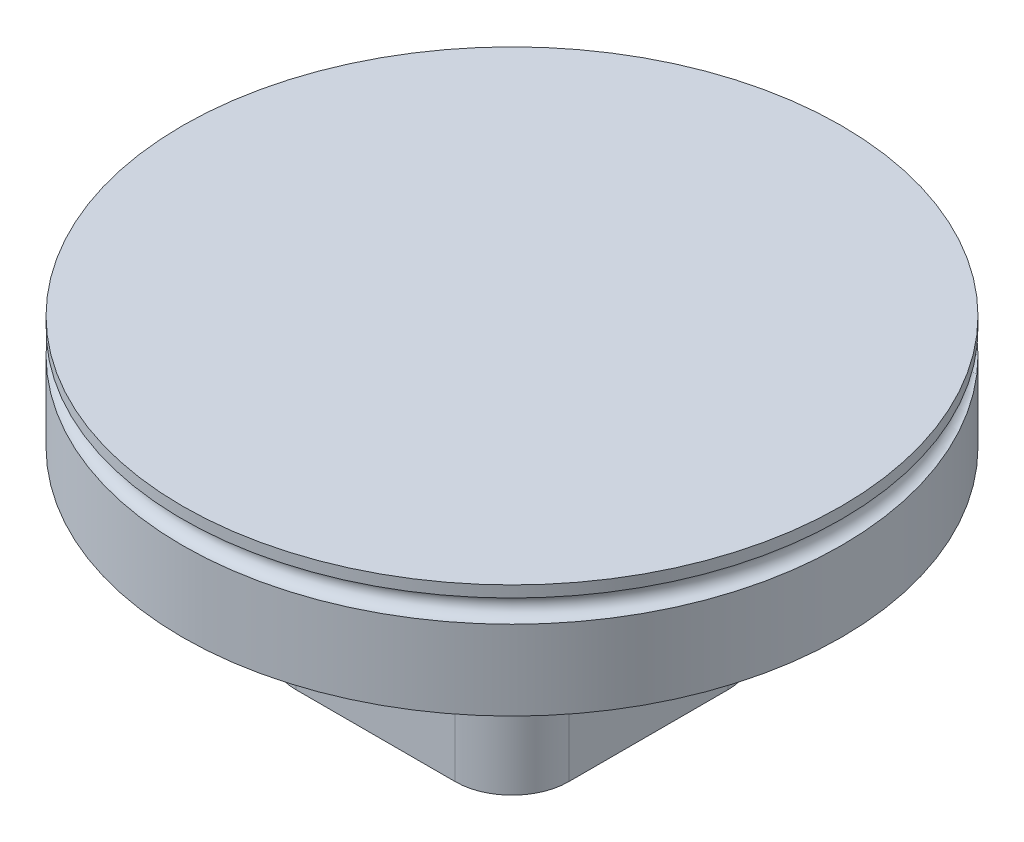
ISO-10303-21;
HEADER;
FILE_DESCRIPTION(('STEP AP214'),'2;1');
FILE_NAME('part.step','',(''),(''),'','','');
FILE_SCHEMA(('AUTOMOTIVE_DESIGN { 1 0 10303 214 1 1 1 1 }'));
ENDSEC;
DATA;
#1=APPLICATION_CONTEXT('core data for automotive mechanical design processes');
#2=APPLICATION_PROTOCOL_DEFINITION('international standard','automotive_design',2000,#1);
#3=PRODUCT_CONTEXT('',#1,'mechanical');
#4=PRODUCT('Part','Part','',(#3));
#5=PRODUCT_RELATED_PRODUCT_CATEGORY('part','',(#4));
#6=PRODUCT_DEFINITION_FORMATION('','',#4);
#7=PRODUCT_DEFINITION_CONTEXT('part definition',#1,'design');
#8=PRODUCT_DEFINITION('design','',#6,#7);
#9=PRODUCT_DEFINITION_SHAPE('','',#8);
#10=(LENGTH_UNIT() NAMED_UNIT(*) SI_UNIT(.MILLI.,.METRE.));
#11=(NAMED_UNIT(*) PLANE_ANGLE_UNIT() SI_UNIT($,.RADIAN.));
#12=(NAMED_UNIT(*) SI_UNIT($,.STERADIAN.) SOLID_ANGLE_UNIT());
#13=UNCERTAINTY_MEASURE_WITH_UNIT(LENGTH_MEASURE(1.E-05),#10,'distance_accuracy_value','');
#14=(GEOMETRIC_REPRESENTATION_CONTEXT(3) GLOBAL_UNCERTAINTY_ASSIGNED_CONTEXT((#13)) GLOBAL_UNIT_ASSIGNED_CONTEXT((#10,
#11,#12)) REPRESENTATION_CONTEXT('',''));
#15=CARTESIAN_POINT('',(0.,0.,0.));
#16=DIRECTION('',(0.,0.,1.));
#17=DIRECTION('',(1.,0.,0.));
#18=AXIS2_PLACEMENT_3D('',#15,#16,#17);
#19=CARTESIAN_POINT('',(0.,10.,0.));
#20=DIRECTION('',(0.,-1.,0.));
#21=DIRECTION('',(0.,0.,-1.00000000000001));
#22=AXIS2_PLACEMENT_3D('',#19,#20,#21);
#23=CYLINDRICAL_SURFACE('',#22,29.);
#24=CARTESIAN_POINT('',(0.,0.,0.));
#25=DIRECTION('',(0.,1.,0.));
#26=DIRECTION('',(0.,0.,1.00000000000001));
#27=AXIS2_PLACEMENT_3D('',#24,#25,#26);
#28=CIRCLE('',#27,29.);
#29=CARTESIAN_POINT('',(0.,0.,29.0000000000002));
#30=VERTEX_POINT('',#29);
#31=EDGE_CURVE('E157',#30,#30,#28,.T.);
#32=ORIENTED_EDGE('',*,*,#31,.T.);
#33=EDGE_LOOP('',(#32));
#34=FACE_BOUND('',#33,.T.);
#35=CARTESIAN_POINT('',(0.,7.,0.));
#36=DIRECTION('',(0.,1.,0.));
#37=DIRECTION('',(-1.00000000000001,0.,0.));
#38=AXIS2_PLACEMENT_3D('',#35,#36,#37);
#39=CIRCLE('',#38,29.);
#40=CARTESIAN_POINT('',(-29.0000000000002,7.00000000000002,0.));
#41=VERTEX_POINT('',#40);
#42=EDGE_CURVE('E50',#41,#41,#39,.T.);
#43=ORIENTED_EDGE('',*,*,#42,.F.);
#44=EDGE_LOOP('',(#43));
#45=FACE_BOUND('',#44,.T.);
#46=ADVANCED_FACE('F46',(#34,#45),#23,.T.);
#47=CARTESIAN_POINT('',(0.,0.,0.));
#48=DIRECTION('',(0.,1.,0.));
#49=DIRECTION('',(0.,0.,1.00000000000001));
#50=AXIS2_PLACEMENT_3D('',#47,#48,#49);
#51=PLANE('',#50);
#52=DIRECTION('',(0.,0.,-1.00000000000001));
#53=VECTOR('',#52,1.);
#54=CARTESIAN_POINT('',(-14.0000000000001,0.,7.00000000000003));
#55=LINE('',#54,#53);
#56=CARTESIAN_POINT('',(-14.0000000000001,0.,-7.));
#57=VERTEX_POINT('',#56);
#58=CARTESIAN_POINT('',(-14.0000000000001,0.,7.00000000000003));
#59=VERTEX_POINT('',#58);
#60=EDGE_CURVE('E195',#57,#59,#55,.F.);
#61=ORIENTED_EDGE('',*,*,#60,.T.);
#62=CARTESIAN_POINT('',(-7.00000000000004,0.,7.00000000000012));
#63=DIRECTION('',(0.,1.,0.));
#64=DIRECTION('',(0.,0.,1.00000000000001));
#65=AXIS2_PLACEMENT_3D('',#62,#63,#64);
#66=CIRCLE('',#65,7.);
#67=CARTESIAN_POINT('',(-7.00000000000005,0.,14.0000000000001));
#68=VERTEX_POINT('',#67);
#69=EDGE_CURVE('E216',#59,#68,#66,.T.);
#70=ORIENTED_EDGE('',*,*,#69,.T.);
#71=DIRECTION('',(-1.00000000000001,0.,0.));
#72=VECTOR('',#71,1.);
#73=CARTESIAN_POINT('',(7.00000000000004,0.,14.0000000000001));
#74=LINE('',#73,#72);
#75=CARTESIAN_POINT('',(7.00000000000004,0.,14.0000000000001));
#76=VERTEX_POINT('',#75);
#77=EDGE_CURVE('E213',#68,#76,#74,.F.);
#78=ORIENTED_EDGE('',*,*,#77,.T.);
#79=CARTESIAN_POINT('',(7.00000000000005,0.,7.00000000000012));
#80=DIRECTION('',(0.,1.,0.));
#81=DIRECTION('',(0.,0.,1.00000000000001));
#82=AXIS2_PLACEMENT_3D('',#79,#80,#81);
#83=CIRCLE('',#82,7.);
#84=CARTESIAN_POINT('',(14.0000000000001,0.,7.00000000000001));
#85=VERTEX_POINT('',#84);
#86=EDGE_CURVE('E210',#76,#85,#83,.T.);
#87=ORIENTED_EDGE('',*,*,#86,.T.);
#88=DIRECTION('',(0.,0.,1.00000000000001));
#89=VECTOR('',#88,1.);
#90=CARTESIAN_POINT('',(14.0000000000001,0.,-7.));
#91=LINE('',#90,#89);
#92=CARTESIAN_POINT('',(14.0000000000001,0.,-7.));
#93=VERTEX_POINT('',#92);
#94=EDGE_CURVE('E207',#85,#93,#91,.F.);
#95=ORIENTED_EDGE('',*,*,#94,.T.);
#96=CARTESIAN_POINT('',(7.00000000000004,0.,-6.99999999999996));
#97=DIRECTION('',(0.,1.,0.));
#98=DIRECTION('',(0.,0.,1.00000000000001));
#99=AXIS2_PLACEMENT_3D('',#96,#97,#98);
#100=CIRCLE('',#99,7.);
#101=CARTESIAN_POINT('',(7.00000000000004,0.,-14.));
#102=VERTEX_POINT('',#101);
#103=EDGE_CURVE('E204',#93,#102,#100,.T.);
#104=ORIENTED_EDGE('',*,*,#103,.T.);
#105=DIRECTION('',(1.00000000000001,0.,0.));
#106=VECTOR('',#105,1.);
#107=CARTESIAN_POINT('',(-7.00000000000005,0.,-14.));
#108=LINE('',#107,#106);
#109=CARTESIAN_POINT('',(-7.00000000000005,0.,-14.));
#110=VERTEX_POINT('',#109);
#111=EDGE_CURVE('E201',#102,#110,#108,.F.);
#112=ORIENTED_EDGE('',*,*,#111,.T.);
#113=CARTESIAN_POINT('',(-7.00000000000005,0.,-6.99999999999996));
#114=DIRECTION('',(0.,1.,0.));
#115=DIRECTION('',(0.,0.,1.00000000000001));
#116=AXIS2_PLACEMENT_3D('',#113,#114,#115);
#117=CIRCLE('',#116,7.);
#118=EDGE_CURVE('E198',#110,#57,#117,.T.);
#119=ORIENTED_EDGE('',*,*,#118,.T.);
#120=EDGE_LOOP('',(#61,#70,#78,#87,#95,#104,#112,#119));
#121=FACE_BOUND('',#120,.T.);
#122=ORIENTED_EDGE('',*,*,#31,.F.);
#123=EDGE_LOOP('',(#122));
#124=FACE_BOUND('',#123,.T.);
#125=ADVANCED_FACE('F285',(#121,#124),#51,.F.);
#126=CARTESIAN_POINT('',(0.,-16.,0.));
#127=DIRECTION('',(0.,1.,0.));
#128=DIRECTION('',(0.,0.,1.00000000000001));
#129=AXIS2_PLACEMENT_3D('',#126,#127,#128);
#130=PLANE('',#129);
#131=DIRECTION('',(0.,0.,-1.00000000000001));
#132=VECTOR('',#131,1.);
#133=CARTESIAN_POINT('',(-12.0000000000001,-16.,-12.));
#134=LINE('',#133,#132);
#135=CARTESIAN_POINT('',(-12.0000000000001,-16.,7.00000000000001));
#136=VERTEX_POINT('',#135);
#137=CARTESIAN_POINT('',(-12.0000000000001,-16.,-7.));
#138=VERTEX_POINT('',#137);
#139=EDGE_CURVE('E145',#136,#138,#134,.T.);
#140=ORIENTED_EDGE('',*,*,#139,.T.);
#141=CARTESIAN_POINT('',(-7.00000000000005,-16.,-6.99999999999989));
#142=DIRECTION('',(0.,1.,0.));
#143=DIRECTION('',(0.,0.,1.00000000000001));
#144=AXIS2_PLACEMENT_3D('',#141,#142,#143);
#145=CIRCLE('',#144,5.);
#146=CARTESIAN_POINT('',(-7.00000000000005,-16.,-12.));
#147=VERTEX_POINT('',#146);
#148=EDGE_CURVE('E138',#138,#147,#145,.F.);
#149=ORIENTED_EDGE('',*,*,#148,.T.);
#150=DIRECTION('',(1.00000000000001,0.,0.));
#151=VECTOR('',#150,1.);
#152=CARTESIAN_POINT('',(-12.0000000000001,-16.,-12.));
#153=LINE('',#152,#151);
#154=CARTESIAN_POINT('',(7.00000000000004,-16.,-12.));
#155=VERTEX_POINT('',#154);
#156=EDGE_CURVE('E142',#147,#155,#153,.T.);
#157=ORIENTED_EDGE('',*,*,#156,.T.);
#158=CARTESIAN_POINT('',(7.00000000000004,-16.,-6.99999999999995));
#159=DIRECTION('',(0.,1.,0.));
#160=DIRECTION('',(0.,0.,1.00000000000001));
#161=AXIS2_PLACEMENT_3D('',#158,#159,#160);
#162=CIRCLE('',#161,5.);
#163=CARTESIAN_POINT('',(12.0000000000001,-16.,-6.99999999999999));
#164=VERTEX_POINT('',#163);
#165=EDGE_CURVE('E148',#155,#164,#162,.F.);
#166=ORIENTED_EDGE('',*,*,#165,.T.);
#167=DIRECTION('',(0.,0.,1.00000000000001));
#168=VECTOR('',#167,1.);
#169=CARTESIAN_POINT('',(12.0000000000001,-16.,-12.));
#170=LINE('',#169,#168);
#171=CARTESIAN_POINT('',(12.0000000000001,-16.,7.00000000000007));
#172=VERTEX_POINT('',#171);
#173=EDGE_CURVE('E391',#164,#172,#170,.T.);
#174=ORIENTED_EDGE('',*,*,#173,.T.);
#175=CARTESIAN_POINT('',(7.00000000000004,-16.,7.00000000000014));
#176=DIRECTION('',(0.,1.,0.));
#177=DIRECTION('',(0.,0.,1.00000000000001));
#178=AXIS2_PLACEMENT_3D('',#175,#176,#177);
#179=CIRCLE('',#178,5.);
#180=CARTESIAN_POINT('',(7.00000000000004,-16.,12.0000000000001));
#181=VERTEX_POINT('',#180);
#182=EDGE_CURVE('E177',#172,#181,#179,.F.);
#183=ORIENTED_EDGE('',*,*,#182,.T.);
#184=DIRECTION('',(-1.00000000000001,0.,0.));
#185=VECTOR('',#184,1.);
#186=CARTESIAN_POINT('',(-12.0000000000001,-16.,12.0000000000001));
#187=LINE('',#186,#185);
#188=CARTESIAN_POINT('',(-7.00000000000005,-16.,12.0000000000001));
#189=VERTEX_POINT('',#188);
#190=EDGE_CURVE('E394',#181,#189,#187,.T.);
#191=ORIENTED_EDGE('',*,*,#190,.T.);
#192=CARTESIAN_POINT('',(-7.00000000000005,-16.,7.00000000000014));
#193=DIRECTION('',(0.,1.,0.));
#194=DIRECTION('',(0.,0.,1.00000000000001));
#195=AXIS2_PLACEMENT_3D('',#192,#193,#194);
#196=CIRCLE('',#195,5.);
#197=EDGE_CURVE('E174',#189,#136,#196,.F.);
#198=ORIENTED_EDGE('',*,*,#197,.T.);
#199=EDGE_LOOP('',(#140,#149,#157,#166,#174,#183,#191,#198));
#200=FACE_BOUND('',#199,.T.);
#201=CARTESIAN_POINT('',(0.,-16.,0.));
#202=DIRECTION('',(0.,-1.,0.));
#203=DIRECTION('',(0.,0.,-1.00000000000001));
#204=AXIS2_PLACEMENT_3D('',#201,#202,#203);
#205=CIRCLE('',#204,10.);
#206=CARTESIAN_POINT('',(0.,-16.,-10.0000000000001));
#207=VERTEX_POINT('',#206);
#208=EDGE_CURVE('E395',#207,#207,#205,.T.);
#209=ORIENTED_EDGE('',*,*,#208,.F.);
#210=EDGE_LOOP('',(#209));
#211=FACE_BOUND('',#210,.T.);
#212=ADVANCED_FACE('F140',(#200,#211),#130,.F.);
#213=CARTESIAN_POINT('',(12.0000000000001,-16.,-12.));
#214=DIRECTION('',(-1.00000000000001,0.,0.));
#215=DIRECTION('',(0.,0.,1.00000000000001));
#216=AXIS2_PLACEMENT_3D('',#213,#214,#215);
#217=PLANE('',#216);
#218=CARTESIAN_POINT('',(12.0000000000001,-8.,0.));
#219=DIRECTION('',(1.00000000000001,0.,0.));
#220=DIRECTION('',(0.,0.,-1.00000000000001));
#221=AXIS2_PLACEMENT_3D('',#218,#219,#220);
#222=CIRCLE('',#221,3.);
#223=CARTESIAN_POINT('',(12.0000000000001,-8.,-3.00000000000002));
#224=VERTEX_POINT('',#223);
#225=EDGE_CURVE('E270',#224,#224,#222,.T.);
#226=ORIENTED_EDGE('',*,*,#225,.F.);
#227=EDGE_LOOP('',(#226));
#228=FACE_BOUND('',#227,.T.);
#229=DIRECTION('',(0.,1.,0.));
#230=VECTOR('',#229,1.);
#231=CARTESIAN_POINT('',(12.0000000000001,-16.,-6.99999999999999));
#232=LINE('',#231,#230);
#233=CARTESIAN_POINT('',(12.0000000000001,-2.,-7.));
#234=VERTEX_POINT('',#233);
#235=EDGE_CURVE('E184',#164,#234,#232,.T.);
#236=ORIENTED_EDGE('',*,*,#235,.T.);
#237=DIRECTION('',(0.,0.,1.00000000000001));
#238=VECTOR('',#237,1.);
#239=CARTESIAN_POINT('',(12.0000000000001,-2.,7.00000000000004));
#240=LINE('',#239,#238);
#241=CARTESIAN_POINT('',(12.0000000000001,-2.,7.00000000000004));
#242=VERTEX_POINT('',#241);
#243=EDGE_CURVE('E230',#234,#242,#240,.T.);
#244=ORIENTED_EDGE('',*,*,#243,.T.);
#245=DIRECTION('',(0.,1.,0.));
#246=VECTOR('',#245,1.);
#247=CARTESIAN_POINT('',(12.0000000000001,-16.,7.00000000000007));
#248=LINE('',#247,#246);
#249=EDGE_CURVE('E147',#242,#172,#248,.F.);
#250=ORIENTED_EDGE('',*,*,#249,.T.);
#251=ORIENTED_EDGE('',*,*,#173,.F.);
#252=EDGE_LOOP('',(#236,#244,#250,#251));
#253=FACE_BOUND('',#252,.T.);
#254=ADVANCED_FACE('F388',(#228,#253),#217,.F.);
#255=CARTESIAN_POINT('',(-12.0000000000001,-16.,12.0000000000001));
#256=DIRECTION('',(0.,0.,-1.00000000000001));
#257=DIRECTION('',(-1.00000000000001,0.,0.));
#258=AXIS2_PLACEMENT_3D('',#255,#256,#257);
#259=PLANE('',#258);
#260=DIRECTION('',(0.,1.,0.));
#261=VECTOR('',#260,1.);
#262=CARTESIAN_POINT('',(7.00000000000004,-16.,12.0000000000001));
#263=LINE('',#262,#261);
#264=CARTESIAN_POINT('',(7.00000000000004,-1.99999999999996,12.0000000000001));
#265=VERTEX_POINT('',#264);
#266=EDGE_CURVE('E191',#181,#265,#263,.T.);
#267=ORIENTED_EDGE('',*,*,#266,.T.);
#268=DIRECTION('',(-1.00000000000001,0.,0.));
#269=VECTOR('',#268,1.);
#270=CARTESIAN_POINT('',(-7.00000000000005,-2.,12.0000000000001));
#271=LINE('',#270,#269);
#272=CARTESIAN_POINT('',(-7.00000000000005,-2.,12.0000000000001));
#273=VERTEX_POINT('',#272);
#274=EDGE_CURVE('E224',#265,#273,#271,.T.);
#275=ORIENTED_EDGE('',*,*,#274,.T.);
#276=DIRECTION('',(0.,1.,0.));
#277=VECTOR('',#276,1.);
#278=CARTESIAN_POINT('',(-7.00000000000005,-16.,12.0000000000001));
#279=LINE('',#278,#277);
#280=EDGE_CURVE('E188',#273,#189,#279,.F.);
#281=ORIENTED_EDGE('',*,*,#280,.T.);
#282=ORIENTED_EDGE('',*,*,#190,.F.);
#283=EDGE_LOOP('',(#267,#275,#281,#282));
#284=FACE_BOUND('',#283,.T.);
#285=ADVANCED_FACE('F425',(#284),#259,.F.);
#286=CARTESIAN_POINT('',(-12.0000000000001,-16.,-12.));
#287=DIRECTION('',(1.00000000000001,0.,0.));
#288=DIRECTION('',(0.,0.,-1.00000000000001));
#289=AXIS2_PLACEMENT_3D('',#286,#287,#288);
#290=PLANE('',#289);
#291=CARTESIAN_POINT('',(-12.0000000000001,-7.99999999999999,0.));
#292=DIRECTION('',(1.00000000000001,0.,0.));
#293=DIRECTION('',(0.,0.,-1.00000000000001));
#294=AXIS2_PLACEMENT_3D('',#291,#292,#293);
#295=CIRCLE('',#294,3.);
#296=CARTESIAN_POINT('',(-12.0000000000001,-7.99999999999999,-3.00000000000002));
#297=VERTEX_POINT('',#296);
#298=EDGE_CURVE('E413',#297,#297,#295,.T.);
#299=ORIENTED_EDGE('',*,*,#298,.T.);
#300=EDGE_LOOP('',(#299));
#301=FACE_BOUND('',#300,.T.);
#302=DIRECTION('',(0.,1.,0.));
#303=VECTOR('',#302,1.);
#304=CARTESIAN_POINT('',(-12.0000000000001,-16.,7.00000000000001));
#305=LINE('',#304,#303);
#306=CARTESIAN_POINT('',(-12.0000000000001,-2.,7.00000000000001));
#307=VERTEX_POINT('',#306);
#308=EDGE_CURVE('E161',#136,#307,#305,.T.);
#309=ORIENTED_EDGE('',*,*,#308,.T.);
#310=DIRECTION('',(0.,0.,-1.00000000000001));
#311=VECTOR('',#310,1.);
#312=CARTESIAN_POINT('',(-12.0000000000001,-1.99999999999998,-7.00000000000003));
#313=LINE('',#312,#311);
#314=CARTESIAN_POINT('',(-12.0000000000001,-1.99999999999998,-7.00000000000003));
#315=VERTEX_POINT('',#314);
#316=EDGE_CURVE('E11',#307,#315,#313,.T.);
#317=ORIENTED_EDGE('',*,*,#316,.T.);
#318=DIRECTION('',(0.,1.,0.));
#319=VECTOR('',#318,1.);
#320=CARTESIAN_POINT('',(-12.0000000000001,-16.,-7.));
#321=LINE('',#320,#319);
#322=EDGE_CURVE('E166',#315,#138,#321,.F.);
#323=ORIENTED_EDGE('',*,*,#322,.T.);
#324=ORIENTED_EDGE('',*,*,#139,.F.);
#325=EDGE_LOOP('',(#309,#317,#323,#324));
#326=FACE_BOUND('',#325,.T.);
#327=ADVANCED_FACE('F431',(#301,#326),#290,.F.);
#328=CARTESIAN_POINT('',(-12.0000000000001,-16.,-12.));
#329=DIRECTION('',(0.,0.,1.00000000000001));
#330=DIRECTION('',(1.00000000000001,0.,0.));
#331=AXIS2_PLACEMENT_3D('',#328,#329,#330);
#332=PLANE('',#331);
#333=DIRECTION('',(0.,1.,0.));
#334=VECTOR('',#333,1.);
#335=CARTESIAN_POINT('',(-7.00000000000005,-16.,-12.));
#336=LINE('',#335,#334);
#337=CARTESIAN_POINT('',(-7.00000000000004,-2.,-12.));
#338=VERTEX_POINT('',#337);
#339=EDGE_CURVE('E152',#147,#338,#336,.T.);
#340=ORIENTED_EDGE('',*,*,#339,.T.);
#341=DIRECTION('',(1.00000000000001,0.,0.));
#342=VECTOR('',#341,1.);
#343=CARTESIAN_POINT('',(7.00000000000004,-1.99999999999998,-12.));
#344=LINE('',#343,#342);
#345=CARTESIAN_POINT('',(7.00000000000004,-1.99999999999998,-12.));
#346=VERTEX_POINT('',#345);
#347=EDGE_CURVE('E236',#338,#346,#344,.T.);
#348=ORIENTED_EDGE('',*,*,#347,.T.);
#349=DIRECTION('',(0.,1.,0.));
#350=VECTOR('',#349,1.);
#351=CARTESIAN_POINT('',(7.00000000000004,-16.,-12.));
#352=LINE('',#351,#350);
#353=EDGE_CURVE('E155',#346,#155,#352,.F.);
#354=ORIENTED_EDGE('',*,*,#353,.T.);
#355=ORIENTED_EDGE('',*,*,#156,.F.);
#356=EDGE_LOOP('',(#340,#348,#354,#355));
#357=FACE_BOUND('',#356,.T.);
#358=ADVANCED_FACE('F151',(#357),#332,.F.);
#359=CARTESIAN_POINT('',(0.,-16.,0.));
#360=DIRECTION('',(0.,1.,0.));
#361=DIRECTION('',(0.,0.,1.00000000000001));
#362=AXIS2_PLACEMENT_3D('',#359,#360,#361);
#363=CYLINDRICAL_SURFACE('',#362,10.);
#364=CARTESIAN_POINT('',(-9.53939201416952,-8.,-3.));
#365=CARTESIAN_POINT('',(-9.53939371453966,-7.83561090411519,-2.99999795267528));
#366=CARTESIAN_POINT('',(-9.5436878041814,-7.67120155171195,-2.98644216334284));
#367=CARTESIAN_POINT('',(-9.56033156605801,-7.34718950081611,-2.93271688893498));
#368=CARTESIAN_POINT('',(-9.5726839298694,-7.18758842699707,-2.89253851147156));
#369=CARTESIAN_POINT('',(-9.60392204971269,-6.87793054345654,-2.78705506539911));
#370=CARTESIAN_POINT('',(-9.62279693406466,-6.72785834073383,-2.72179178788486));
#371=CARTESIAN_POINT('',(-9.66493865095137,-6.4407561320094,-2.56812843835857));
#372=CARTESIAN_POINT('',(-9.68820614082046,-6.30372808263112,-2.47972490274105));
#373=CARTESIAN_POINT('',(-9.73733724371538,-6.04226721884525,-2.27929508283253));
#374=CARTESIAN_POINT('',(-9.76325616623274,-5.91830820410742,-2.16666414351611));
#375=CARTESIAN_POINT('',(-9.81429723873516,-5.69072409735498,-1.92227247515918));
#376=CARTESIAN_POINT('',(-9.83941928595415,-5.58710161910024,-1.79050929092222));
#377=CARTESIAN_POINT('',(-9.88666429158783,-5.40107460033338,-1.50822287558736));
#378=CARTESIAN_POINT('',(-9.9087144868481,-5.31915315111437,-1.35736804267159));
#379=CARTESIAN_POINT('',(-9.94668871841372,-5.18202548191448,-1.04324929073862));
#380=CARTESIAN_POINT('',(-9.96261407578999,-5.1268135002851,-0.879988056775717));
#381=CARTESIAN_POINT('',(-9.98615292007184,-5.04623999781899,-0.550647705261534));
#382=CARTESIAN_POINT('',(-9.99399114738675,-5.0200697446946,-0.384782797907478));
#383=CARTESIAN_POINT('',(-10.001264030027,-4.99576535070713,-0.0508436474985039));
#384=CARTESIAN_POINT('',(-10.0007004504218,-4.99762532119607,0.117230124100867));
#385=CARTESIAN_POINT('',(-9.99139207635311,-5.02878573708604,0.445142313200408));
#386=CARTESIAN_POINT('',(-9.98290840410477,-5.05721038761973,0.605072535282725));
#387=CARTESIAN_POINT('',(-9.95903044225232,-5.13926267198865,0.917778426885102));
#388=CARTESIAN_POINT('',(-9.94363571501347,-5.1928919018855,1.07055364264579));
#389=CARTESIAN_POINT('',(-9.90730441973763,-5.32442404683695,1.36669465270247));
#390=CARTESIAN_POINT('',(-9.88630539352775,-5.40260240561395,1.50993012938862));
#391=CARTESIAN_POINT('',(-9.84099281296779,-5.58079570485706,1.78152934756662));
#392=CARTESIAN_POINT('',(-9.81667847277948,-5.68081582592918,1.90988954974545));
#393=CARTESIAN_POINT('',(-9.76623100973856,-5.90439550150092,2.15332096305837));
#394=CARTESIAN_POINT('',(-9.74006390633504,-6.02871383805082,2.26768916079754));
#395=CARTESIAN_POINT('',(-9.68967959784416,-6.29502003578883,2.47415303080119));
#396=CARTESIAN_POINT('',(-9.66546258669247,-6.43700965081096,2.56624648967465));
#397=CARTESIAN_POINT('',(-9.62155806359718,-6.73647893847215,2.72627990669523));
#398=CARTESIAN_POINT('',(-9.60191621258492,-6.8940940916175,2.7939797846938));
#399=CARTESIAN_POINT('',(-9.56992784963792,-7.21921441677862,2.90166725750736));
#400=CARTESIAN_POINT('',(-9.55757895796646,-7.38671634303506,2.94166389279495));
#401=CARTESIAN_POINT('',(-9.54209699116246,-7.72016472150243,2.99149540565764));
#402=CARTESIAN_POINT('',(-9.5386375734992,-7.88593644779435,3.00239892760807));
#403=CARTESIAN_POINT('',(-9.54042384874814,-8.21694580001335,2.99671894465742));
#404=CARTESIAN_POINT('',(-9.54566832310791,-8.38218349746001,2.98013928742562));
#405=CARTESIAN_POINT('',(-9.56395117112158,-8.70297675594338,2.92091527148481));
#406=CARTESIAN_POINT('',(-9.57678353015603,-8.85867232852746,2.87895922862586));
#407=CARTESIAN_POINT('',(-9.60858282461831,-9.16080338162937,2.77097155495857));
#408=CARTESIAN_POINT('',(-9.62755070717982,-9.30723742828102,2.70493620685523));
#409=CARTESIAN_POINT('',(-9.67011670046273,-9.59103492814439,2.54863742393021));
#410=CARTESIAN_POINT('',(-9.69382542139645,-9.7280494419716,2.45777128345466));
#411=CARTESIAN_POINT('',(-9.74296411293929,-9.98527621236154,2.25510603200768));
#412=CARTESIAN_POINT('',(-9.76839449459998,-10.1054844352256,2.14330191069794));
#413=CARTESIAN_POINT('',(-9.81927267096335,-10.3303608116295,1.89691026498722));
#414=CARTESIAN_POINT('',(-9.84468490126013,-10.434271257974,1.76162213171488));
#415=CARTESIAN_POINT('',(-9.89169703497299,-10.6179334020555,1.47492356918049));
#416=CARTESIAN_POINT('',(-9.91329712769438,-10.6976862995629,1.32351394108788));
#417=CARTESIAN_POINT('',(-9.9501194094992,-10.8300000611366,1.00987100941045));
#418=CARTESIAN_POINT('',(-9.96538906849933,-10.882764032318,0.84772924407571));
#419=CARTESIAN_POINT('',(-9.98803959193654,-10.9601218377808,0.516339933009254));
#420=CARTESIAN_POINT('',(-9.99542271341765,-10.9847237318968,0.347094434709627));
#421=CARTESIAN_POINT('',(-10.001330881628,-11.004446088109,0.0133043077656101));
#422=CARTESIAN_POINT('',(-10.0001861022265,-11.0006653908157,-0.15117035817229));
#423=CARTESIAN_POINT('',(-9.98994528930075,-10.9663567350018,-0.477038962328682));
#424=CARTESIAN_POINT('',(-9.98084970660931,-10.9358302930391,-0.638433074692929));
#425=CARTESIAN_POINT('',(-9.95582336716659,-10.8495766772008,-0.951871626082619));
#426=CARTESIAN_POINT('',(-9.93996705801734,-10.794123638702,-1.10399785470272));
#427=CARTESIAN_POINT('',(-9.90305886078901,-10.6598361709857,-1.39686647550408));
#428=CARTESIAN_POINT('',(-9.88200611899897,-10.5809978994276,-1.53760699210114));
#429=CARTESIAN_POINT('',(-9.83607931656462,-10.3992530851399,-1.80860378484112));
#430=CARTESIAN_POINT('',(-9.81110453847121,-10.2956571399985,-1.93838050015354));
#431=CARTESIAN_POINT('',(-9.7604707442467,-10.0685792233344,-2.17907514269184));
#432=CARTESIAN_POINT('',(-9.73481153282163,-9.94509152420369,-2.28998761920376));
#433=CARTESIAN_POINT('',(-9.68481361262642,-9.67731844337897,-2.49312538789087));
#434=CARTESIAN_POINT('',(-9.66053705386972,-9.53252289321915,-2.5846951951591));
#435=CARTESIAN_POINT('',(-9.61705095017588,-9.22888965167799,-2.74208627057554));
#436=CARTESIAN_POINT('',(-9.59783897193917,-9.07005875279761,-2.80791991114577));
#437=CARTESIAN_POINT('',(-9.56855633435194,-8.76051913678744,-2.90603885065898));
#438=CARTESIAN_POINT('',(-9.55772309681041,-8.61078270613801,-2.94117718022463));
#439=CARTESIAN_POINT('',(-9.54314085194335,-8.30736955500846,-2.98815637670289));
#440=CARTESIAN_POINT('',(-9.53939042442867,-8.15369363070951,-3.00000191412191));
#441=CARTESIAN_POINT('',(-9.53939201416952,-8.,-3.));
#442=B_SPLINE_CURVE_WITH_KNOTS('',3,(#364,#365,#366,#367,#368,#369,#370,#371,#372,#373,#374,
#375,#376,#377,#378,#379,#380,#381,#382,#383,#384,#385,#386,#387,#388,#389,#390,#391,#392,#393,
#394,#395,#396,#397,#398,#399,#400,#401,#402,#403,#404,#405,#406,#407,#408,#409,#410,#411,#412,
#413,#414,#415,#416,#417,#418,#419,#420,#421,#422,#423,#424,#425,#426,#427,#428,#429,#430,#431,
#432,#433,#434,#435,#436,#437,#438,#439,#440,#441),.UNSPECIFIED.,.T.,.F.,(4,2,2,2,2,2,2,2,2,2,2,
2,2,2,2,2,2,2,2,2,2,2,2,2,2,2,2,2,2,2,2,2,2,2,2,2,2,2,4),(0.,0.492600331831089,
0.985365283378001,1.47731282893239,1.96933405074022,2.47546300015969,2.98165695742546,
3.49831878547295,4.01486911175766,4.51664280299127,5.01831108202891,5.50400251981765,
5.9897247178075,6.48110418671351,6.9726003318166,7.48304294046558,7.99353624983731,
8.50892476494936,9.02414501262033,9.52016161585829,10.0161087821999,10.4991718988284,
10.9823096209678,11.4784146362398,11.9746385186306,12.4895901220642,13.0045161465362,
13.5155078363386,14.0263532464857,14.5175260782764,15.0086710610071,15.4945419374965,
15.9804926898797,16.4819925411419,16.9836370526499,17.500232793435,18.016579879331,
18.4772230772011,18.9377739007233),.UNSPECIFIED.);
#443=CARTESIAN_POINT('',(-9.53939201416952,-8.,-3.));
#444=VERTEX_POINT('',#443);
#445=EDGE_CURVE('E323',#444,#444,#442,.T.);
#446=ORIENTED_EDGE('',*,*,#445,.F.);
#447=EDGE_LOOP('',(#446));
#448=FACE_BOUND('',#447,.T.);
#449=CARTESIAN_POINT('',(9.5393920141695,-7.99999999999999,-3.));
#450=CARTESIAN_POINT('',(9.53939371453965,-8.1643890958848,-2.99999795267528));
#451=CARTESIAN_POINT('',(9.54368780418137,-8.32879844828805,-2.98644216334285));
#452=CARTESIAN_POINT('',(9.56033156605797,-8.65281049918388,-2.93271688893498));
#453=CARTESIAN_POINT('',(9.57268392986937,-8.81241157300292,-2.89253851147154));
#454=CARTESIAN_POINT('',(9.60392204971267,-9.12206945654347,-2.7870550653991));
#455=CARTESIAN_POINT('',(9.62279693406463,-9.27214165926621,-2.72179178788488));
#456=CARTESIAN_POINT('',(9.66493865095133,-9.55924386799063,-2.56812843835855));
#457=CARTESIAN_POINT('',(9.68820614082042,-9.69627191736887,-2.47972490274096));
#458=CARTESIAN_POINT('',(9.73733724371534,-9.95773278115475,-2.27929508283243));
#459=CARTESIAN_POINT('',(9.7632561662327,-10.0816917958926,-2.16666414351608));
#460=CARTESIAN_POINT('',(9.81429723873513,-10.3092759026451,-1.92227247515919));
#461=CARTESIAN_POINT('',(9.83941928595415,-10.4128983808998,-1.79050929092221));
#462=CARTESIAN_POINT('',(9.88666429158782,-10.5989253996666,-1.50822287558736));
#463=CARTESIAN_POINT('',(9.90871448684806,-10.6808468488857,-1.3573680426716));
#464=CARTESIAN_POINT('',(9.94668871841369,-10.8179745180856,-1.04324929073864));
#465=CARTESIAN_POINT('',(9.96261407578999,-10.8731864997149,-0.879988056775722));
#466=CARTESIAN_POINT('',(9.98615292007185,-10.953760002181,-0.55064770526153));
#467=CARTESIAN_POINT('',(9.99399114738673,-10.9799302553054,-0.384782797907477));
#468=CARTESIAN_POINT('',(10.001264030027,-11.0042346492929,-0.0508436474985059));
#469=CARTESIAN_POINT('',(10.0007004504218,-11.0023746788039,0.117230124100864));
#470=CARTESIAN_POINT('',(9.99139207635309,-10.971214262914,0.445142313200418));
#471=CARTESIAN_POINT('',(9.98290840410474,-10.9427896123803,0.605072535282749));
#472=CARTESIAN_POINT('',(9.95903044225228,-10.8607373280114,0.917778426885137));
#473=CARTESIAN_POINT('',(9.94363571501342,-10.8071080981145,1.07055364264583));
#474=CARTESIAN_POINT('',(9.90730441973757,-10.675575953163,1.36669465270251));
#475=CARTESIAN_POINT('',(9.8863053935277,-10.5973975943861,1.50993012938867));
#476=CARTESIAN_POINT('',(9.84099281296776,-10.419204295143,1.78152934756664));
#477=CARTESIAN_POINT('',(9.81667847277947,-10.3191841740708,1.90988954974545));
#478=CARTESIAN_POINT('',(9.76623100973855,-10.0956044984991,2.15332096305837));
#479=CARTESIAN_POINT('',(9.74006390633501,-9.97128616194922,2.26768916079756));
#480=CARTESIAN_POINT('',(9.68967959784412,-9.7049799642112,2.47415303080117));
#481=CARTESIAN_POINT('',(9.66546258669246,-9.56299034918903,2.56624648967455));
#482=CARTESIAN_POINT('',(9.62155806359716,-9.26352106152782,2.72627990669514));
#483=CARTESIAN_POINT('',(9.60191621258488,-9.1059059083825,2.79397978469379));
#484=CARTESIAN_POINT('',(9.56992784963788,-8.7807855832214,2.9016672575074));
#485=CARTESIAN_POINT('',(9.55757895796644,-8.61328365696494,2.94166389279495));
#486=CARTESIAN_POINT('',(9.54209699116243,-8.27983527849756,2.99149540565763));
#487=CARTESIAN_POINT('',(9.53863757349915,-8.11406355220564,3.00239892760807));
#488=CARTESIAN_POINT('',(9.54042384874812,-7.78305419998665,2.99671894465741));
#489=CARTESIAN_POINT('',(9.54566832310794,-7.61781650253999,2.9801392874256));
#490=CARTESIAN_POINT('',(9.56395117112161,-7.29702324405661,2.92091527148479));
#491=CARTESIAN_POINT('',(9.57678353015602,-7.14132767147251,2.87895922862586));
#492=CARTESIAN_POINT('',(9.60858282461827,-6.83919661837061,2.77097155495853));
#493=CARTESIAN_POINT('',(9.6275507071798,-6.69276257171898,2.70493620685514));
#494=CARTESIAN_POINT('',(9.67011670046272,-6.40896507185562,2.54863742393011));
#495=CARTESIAN_POINT('',(9.69382542139642,-6.27195055802839,2.45777128345459));
#496=CARTESIAN_POINT('',(9.74296411293927,-6.01472378763843,2.25510603200766));
#497=CARTESIAN_POINT('',(9.76839449459998,-5.89451556477442,2.14330191069793));
#498=CARTESIAN_POINT('',(9.81927267096334,-5.66963918837051,1.8969102649872));
#499=CARTESIAN_POINT('',(9.84468490126009,-5.56572874202604,1.76162213171485));
#500=CARTESIAN_POINT('',(9.89169703497297,-5.3820665979445,1.47492356918048));
#501=CARTESIAN_POINT('',(9.9132971276944,-5.30231370043707,1.32351394108789));
#502=CARTESIAN_POINT('',(9.95011940949922,-5.16999993886341,1.00987100941047));
#503=CARTESIAN_POINT('',(9.96538906849931,-5.11723596768208,0.84772924407571));
#504=CARTESIAN_POINT('',(9.9880395919365,-5.03987816221919,0.516339933009245));
#505=CARTESIAN_POINT('',(9.99542271341761,-5.01527626810317,0.347094434709623));
#506=CARTESIAN_POINT('',(10.001330881628,-4.99555391189099,0.0133043077655958));
#507=CARTESIAN_POINT('',(10.0001861022264,-4.99933460918434,-0.15117035817232));
#508=CARTESIAN_POINT('',(9.98994528930072,-5.03364326499825,-0.477038962328755));
#509=CARTESIAN_POINT('',(9.98084970660927,-5.06416970696089,-0.638433074693028));
#510=CARTESIAN_POINT('',(9.95582336716654,-5.15042332279925,-0.951871626082704));
#511=CARTESIAN_POINT('',(9.93996705801728,-5.20587636129804,-1.10399785470277));
#512=CARTESIAN_POINT('',(9.903058860789,-5.34016382901439,-1.39686647550409));
#513=CARTESIAN_POINT('',(9.88200611899899,-5.41900210057238,-1.53760699210116));
#514=CARTESIAN_POINT('',(9.83607931656464,-5.60074691486005,-1.80860378484112));
#515=CARTESIAN_POINT('',(9.81110453847119,-5.7043428600015,-1.93838050015351));
#516=CARTESIAN_POINT('',(9.76047074424665,-5.93142077666558,-2.17907514269182));
#517=CARTESIAN_POINT('',(9.7348115328216,-6.05490847579631,-2.28998761920376));
#518=CARTESIAN_POINT('',(9.6848136126264,-6.32268155662103,-2.49312538789087));
#519=CARTESIAN_POINT('',(9.66053705386969,-6.46747710678086,-2.58469519515908));
#520=CARTESIAN_POINT('',(9.61705095017586,-6.77111034832201,-2.74208627057552));
#521=CARTESIAN_POINT('',(9.59783897193917,-6.92994124720239,-2.80791991114577));
#522=CARTESIAN_POINT('',(9.56855633435193,-7.23948086321255,-2.90603885065898));
#523=CARTESIAN_POINT('',(9.55772309681038,-7.38921729386198,-2.94117718022463));
#524=CARTESIAN_POINT('',(9.54314085194332,-7.69263044499153,-2.98815637670288));
#525=CARTESIAN_POINT('',(9.53939042442865,-7.84630636929049,-3.0000019141219));
#526=CARTESIAN_POINT('',(9.5393920141695,-7.99999999999999,-3.));
#527=B_SPLINE_CURVE_WITH_KNOTS('',3,(#449,#450,#451,#452,#453,#454,#455,#456,#457,#458,#459,
#460,#461,#462,#463,#464,#465,#466,#467,#468,#469,#470,#471,#472,#473,#474,#475,#476,#477,#478,
#479,#480,#481,#482,#483,#484,#485,#486,#487,#488,#489,#490,#491,#492,#493,#494,#495,#496,#497,
#498,#499,#500,#501,#502,#503,#504,#505,#506,#507,#508,#509,#510,#511,#512,#513,#514,#515,#516,
#517,#518,#519,#520,#521,#522,#523,#524,#525,#526),.UNSPECIFIED.,.T.,.F.,(4,2,2,2,2,2,2,2,2,2,2,
2,2,2,2,2,2,2,2,2,2,2,2,2,2,2,2,2,2,2,2,2,2,2,2,2,2,2,4),(0.,0.492600331831092,
0.985365283378005,1.47731282893242,1.96933405074027,2.47546300015972,2.98165695742546,
3.49831878547294,4.01486911175766,4.51664280299127,5.01831108202892,5.50400251981768,
5.98972471780756,6.48110418671355,6.97260033181662,7.48304294046557,7.99353624983729,
8.50892476494936,9.02414501262034,9.5201616158583,10.0161087821999,10.4991718988284,
10.9823096209678,11.4784146362399,11.9746385186306,12.4895901220642,13.0045161465362,
13.5155078363385,14.0263532464856,14.5175260782764,15.0086710610072,15.4945419374965,
15.9804926898796,16.4819925411418,16.9836370526498,17.500232793435,18.016579879331,
18.477223077201,18.9377739007233),.UNSPECIFIED.);
#528=CARTESIAN_POINT('',(9.5393920141695,-7.99999999999999,-3.));
#529=VERTEX_POINT('',#528);
#530=EDGE_CURVE('E315',#529,#529,#527,.T.);
#531=ORIENTED_EDGE('',*,*,#530,.F.);
#532=EDGE_LOOP('',(#531));
#533=FACE_BOUND('',#532,.T.);
#534=ORIENTED_EDGE('',*,*,#208,.T.);
#535=EDGE_LOOP('',(#534));
#536=FACE_BOUND('',#535,.T.);
#537=CARTESIAN_POINT('',(0.,0.,0.));
#538=DIRECTION('',(0.,-1.,0.));
#539=DIRECTION('',(0.,0.,-1.00000000000001));
#540=AXIS2_PLACEMENT_3D('',#537,#538,#539);
#541=CIRCLE('',#540,10.);
#542=CARTESIAN_POINT('',(0.,0.,-10.0000000000001));
#543=VERTEX_POINT('',#542);
#544=EDGE_CURVE('E403',#543,#543,#541,.T.);
#545=ORIENTED_EDGE('',*,*,#544,.F.);
#546=EDGE_LOOP('',(#545));
#547=FACE_BOUND('',#546,.T.);
#548=ADVANCED_FACE('F327',(#448,#533,#536,#547),#363,.F.);
#549=ORIENTED_EDGE('',*,*,#544,.T.);
#550=EDGE_LOOP('',(#549));
#551=FACE_BOUND('',#550,.T.);
#552=ADVANCED_FACE('F294',(#551),#51,.F.);
#553=CARTESIAN_POINT('',(-29.0000000000002,-8.00000000000002,0.));
#554=DIRECTION('',(1.00000000000001,0.,0.));
#555=DIRECTION('',(0.,0.,-1.00000000000001));
#556=AXIS2_PLACEMENT_3D('',#553,#554,#555);
#557=CYLINDRICAL_SURFACE('',#556,3.);
#558=ORIENTED_EDGE('',*,*,#530,.T.);
#559=EDGE_LOOP('',(#558));
#560=FACE_BOUND('',#559,.T.);
#561=ORIENTED_EDGE('',*,*,#225,.T.);
#562=EDGE_LOOP('',(#561));
#563=FACE_BOUND('',#562,.T.);
#564=ADVANCED_FACE('F330',(#560,#563),#557,.F.);
#565=ORIENTED_EDGE('',*,*,#445,.T.);
#566=EDGE_LOOP('',(#565));
#567=FACE_BOUND('',#566,.T.);
#568=ORIENTED_EDGE('',*,*,#298,.F.);
#569=EDGE_LOOP('',(#568));
#570=FACE_BOUND('',#569,.T.);
#571=ADVANCED_FACE('F334',(#567,#570),#557,.F.);
#572=CARTESIAN_POINT('',(-7.00000000000005,-16.,-6.99999999999989));
#573=DIRECTION('',(0.,1.,0.));
#574=DIRECTION('',(0.,0.,1.00000000000001));
#575=AXIS2_PLACEMENT_3D('',#572,#573,#574);
#576=CYLINDRICAL_SURFACE('',#575,5.);
#577=ORIENTED_EDGE('',*,*,#322,.F.);
#578=CARTESIAN_POINT('',(-7.00000000000005,-2.,-6.99999999999999));
#579=DIRECTION('',(0.,1.,0.));
#580=DIRECTION('',(0.,0.,1.00000000000001));
#581=AXIS2_PLACEMENT_3D('',#578,#579,#580);
#582=CIRCLE('',#581,5.);
#583=EDGE_CURVE('E56',#315,#338,#582,.F.);
#584=ORIENTED_EDGE('',*,*,#583,.T.);
#585=ORIENTED_EDGE('',*,*,#339,.F.);
#586=ORIENTED_EDGE('',*,*,#148,.F.);
#587=EDGE_LOOP('',(#577,#584,#585,#586));
#588=FACE_BOUND('',#587,.T.);
#589=ADVANCED_FACE('F159',(#588),#576,.T.);
#590=CARTESIAN_POINT('',(7.00000000000004,-16.,-6.99999999999995));
#591=DIRECTION('',(0.,1.,0.));
#592=DIRECTION('',(0.,0.,1.00000000000001));
#593=AXIS2_PLACEMENT_3D('',#590,#591,#592);
#594=CYLINDRICAL_SURFACE('',#593,5.);
#595=ORIENTED_EDGE('',*,*,#353,.F.);
#596=CARTESIAN_POINT('',(7.00000000000004,-1.99999999999997,-6.99999999999999));
#597=DIRECTION('',(0.,1.,0.));
#598=DIRECTION('',(0.,0.,1.00000000000001));
#599=AXIS2_PLACEMENT_3D('',#596,#597,#598);
#600=CIRCLE('',#599,5.);
#601=EDGE_CURVE('E233',#346,#234,#600,.F.);
#602=ORIENTED_EDGE('',*,*,#601,.T.);
#603=ORIENTED_EDGE('',*,*,#235,.F.);
#604=ORIENTED_EDGE('',*,*,#165,.F.);
#605=EDGE_LOOP('',(#595,#602,#603,#604));
#606=FACE_BOUND('',#605,.T.);
#607=ADVANCED_FACE('F385',(#606),#594,.T.);
#608=CARTESIAN_POINT('',(7.00000000000004,-16.,7.00000000000014));
#609=DIRECTION('',(0.,1.,0.));
#610=DIRECTION('',(0.,0.,1.00000000000001));
#611=AXIS2_PLACEMENT_3D('',#608,#609,#610);
#612=CYLINDRICAL_SURFACE('',#611,5.);
#613=ORIENTED_EDGE('',*,*,#249,.F.);
#614=CARTESIAN_POINT('',(7.00000000000006,-1.99999999999996,7.00000000000012));
#615=DIRECTION('',(0.,1.,0.));
#616=DIRECTION('',(0.,0.,1.00000000000001));
#617=AXIS2_PLACEMENT_3D('',#614,#615,#616);
#618=CIRCLE('',#617,5.);
#619=EDGE_CURVE('E227',#242,#265,#618,.F.);
#620=ORIENTED_EDGE('',*,*,#619,.T.);
#621=ORIENTED_EDGE('',*,*,#266,.F.);
#622=ORIENTED_EDGE('',*,*,#182,.F.);
#623=EDGE_LOOP('',(#613,#620,#621,#622));
#624=FACE_BOUND('',#623,.T.);
#625=ADVANCED_FACE('F486',(#624),#612,.T.);
#626=CARTESIAN_POINT('',(-7.00000000000005,-16.,7.00000000000014));
#627=DIRECTION('',(0.,1.,0.));
#628=DIRECTION('',(0.,0.,1.00000000000001));
#629=AXIS2_PLACEMENT_3D('',#626,#627,#628);
#630=CYLINDRICAL_SURFACE('',#629,5.);
#631=ORIENTED_EDGE('',*,*,#280,.F.);
#632=CARTESIAN_POINT('',(-7.00000000000004,-2.,7.00000000000012));
#633=DIRECTION('',(0.,1.,0.));
#634=DIRECTION('',(0.,0.,1.00000000000001));
#635=AXIS2_PLACEMENT_3D('',#632,#633,#634);
#636=CIRCLE('',#635,5.);
#637=EDGE_CURVE('E220',#273,#307,#636,.F.);
#638=ORIENTED_EDGE('',*,*,#637,.T.);
#639=ORIENTED_EDGE('',*,*,#308,.F.);
#640=ORIENTED_EDGE('',*,*,#197,.F.);
#641=EDGE_LOOP('',(#631,#638,#639,#640));
#642=FACE_BOUND('',#641,.T.);
#643=ADVANCED_FACE('F352',(#642),#630,.T.);
#644=CARTESIAN_POINT('',(7.00000000000004,-1.99999999999997,-6.99999999999999));
#645=DIRECTION('',(0.,1.,0.));
#646=DIRECTION('',(0.,0.,1.00000000000001));
#647=AXIS2_PLACEMENT_3D('',#644,#645,#646);
#648=TOROIDAL_SURFACE('',#647,7.,2.);
#649=CARTESIAN_POINT('',(14.0000000000001,-2.,-7.));
#650=DIRECTION('',(0.,0.,-1.00000000000001));
#651=DIRECTION('',(-1.00000000000001,0.,0.));
#652=AXIS2_PLACEMENT_3D('',#649,#650,#651);
#653=CIRCLE('',#652,2.);
#654=EDGE_CURVE('E263',#234,#93,#653,.T.);
#655=ORIENTED_EDGE('',*,*,#654,.F.);
#656=ORIENTED_EDGE('',*,*,#601,.F.);
#657=CARTESIAN_POINT('',(7.00000000000004,-1.99999999999998,-14.));
#658=DIRECTION('',(1.00000000000001,0.,0.));
#659=DIRECTION('',(0.,0.,-1.00000000000001));
#660=AXIS2_PLACEMENT_3D('',#657,#658,#659);
#661=CIRCLE('',#660,2.);
#662=EDGE_CURVE('E267',#102,#346,#661,.T.);
#663=ORIENTED_EDGE('',*,*,#662,.F.);
#664=ORIENTED_EDGE('',*,*,#103,.F.);
#665=EDGE_LOOP('',(#655,#656,#663,#664));
#666=FACE_BOUND('',#665,.T.);
#667=ADVANCED_FACE('F48',(#666),#648,.F.);
#668=CARTESIAN_POINT('',(-12.0000000000001,-2.,-14.));
#669=DIRECTION('',(-1.00000000000001,0.,0.));
#670=DIRECTION('',(0.,0.,1.00000000000001));
#671=AXIS2_PLACEMENT_3D('',#668,#669,#670);
#672=CYLINDRICAL_SURFACE('',#671,2.);
#673=ORIENTED_EDGE('',*,*,#662,.T.);
#674=ORIENTED_EDGE('',*,*,#347,.F.);
#675=CARTESIAN_POINT('',(-7.00000000000005,-2.00000000000001,-14.));
#676=DIRECTION('',(1.00000000000001,0.,0.));
#677=DIRECTION('',(0.,0.,-1.00000000000001));
#678=AXIS2_PLACEMENT_3D('',#675,#676,#677);
#679=CIRCLE('',#678,2.);
#680=EDGE_CURVE('E259',#110,#338,#679,.T.);
#681=ORIENTED_EDGE('',*,*,#680,.F.);
#682=ORIENTED_EDGE('',*,*,#111,.F.);
#683=EDGE_LOOP('',(#673,#674,#681,#682));
#684=FACE_BOUND('',#683,.T.);
#685=ADVANCED_FACE('F368',(#684),#672,.F.);
#686=CARTESIAN_POINT('',(14.0000000000001,-2.,-12.));
#687=DIRECTION('',(0.,0.,-1.00000000000001));
#688=DIRECTION('',(-1.00000000000001,0.,0.));
#689=AXIS2_PLACEMENT_3D('',#686,#687,#688);
#690=CYLINDRICAL_SURFACE('',#689,2.);
#691=ORIENTED_EDGE('',*,*,#654,.T.);
#692=ORIENTED_EDGE('',*,*,#94,.F.);
#693=CARTESIAN_POINT('',(14.0000000000001,-2.,7.00000000000001));
#694=DIRECTION('',(0.,0.,-1.00000000000001));
#695=DIRECTION('',(-1.00000000000001,0.,0.));
#696=AXIS2_PLACEMENT_3D('',#693,#694,#695);
#697=CIRCLE('',#696,2.);
#698=EDGE_CURVE('E255',#242,#85,#697,.T.);
#699=ORIENTED_EDGE('',*,*,#698,.F.);
#700=ORIENTED_EDGE('',*,*,#243,.F.);
#701=EDGE_LOOP('',(#691,#692,#699,#700));
#702=FACE_BOUND('',#701,.T.);
#703=ADVANCED_FACE('F365',(#702),#690,.F.);
#704=CARTESIAN_POINT('',(-7.00000000000005,-2.,-6.99999999999999));
#705=DIRECTION('',(0.,1.,0.));
#706=DIRECTION('',(0.,0.,1.00000000000001));
#707=AXIS2_PLACEMENT_3D('',#704,#705,#706);
#708=TOROIDAL_SURFACE('',#707,7.,2.);
#709=ORIENTED_EDGE('',*,*,#680,.T.);
#710=ORIENTED_EDGE('',*,*,#583,.F.);
#711=CARTESIAN_POINT('',(-14.0000000000001,-1.99999999999998,-7.));
#712=DIRECTION('',(0.,0.,-1.00000000000001));
#713=DIRECTION('',(-1.00000000000001,0.,0.));
#714=AXIS2_PLACEMENT_3D('',#711,#712,#713);
#715=CIRCLE('',#714,2.);
#716=EDGE_CURVE('E251',#57,#315,#715,.T.);
#717=ORIENTED_EDGE('',*,*,#716,.F.);
#718=ORIENTED_EDGE('',*,*,#118,.F.);
#719=EDGE_LOOP('',(#709,#710,#717,#718));
#720=FACE_BOUND('',#719,.T.);
#721=ADVANCED_FACE('F361',(#720),#708,.F.);
#722=CARTESIAN_POINT('',(7.00000000000006,-1.99999999999996,7.00000000000012));
#723=DIRECTION('',(0.,1.,0.));
#724=DIRECTION('',(0.,0.,1.00000000000001));
#725=AXIS2_PLACEMENT_3D('',#722,#723,#724);
#726=TOROIDAL_SURFACE('',#725,7.,2.);
#727=ORIENTED_EDGE('',*,*,#698,.T.);
#728=ORIENTED_EDGE('',*,*,#86,.F.);
#729=CARTESIAN_POINT('',(7.00000000000006,-1.99999999999994,14.0000000000001));
#730=DIRECTION('',(1.00000000000001,0.,0.));
#731=DIRECTION('',(0.,0.,-1.00000000000001));
#732=AXIS2_PLACEMENT_3D('',#729,#730,#731);
#733=CIRCLE('',#732,2.);
#734=EDGE_CURVE('E247',#265,#76,#733,.T.);
#735=ORIENTED_EDGE('',*,*,#734,.F.);
#736=ORIENTED_EDGE('',*,*,#619,.F.);
#737=EDGE_LOOP('',(#727,#728,#735,#736));
#738=FACE_BOUND('',#737,.T.);
#739=ADVANCED_FACE('F357',(#738),#726,.F.);
#740=CARTESIAN_POINT('',(-14.0000000000001,-1.99999999999998,-12.));
#741=DIRECTION('',(0.,0.,1.00000000000001));
#742=DIRECTION('',(1.00000000000001,0.,0.));
#743=AXIS2_PLACEMENT_3D('',#740,#741,#742);
#744=CYLINDRICAL_SURFACE('',#743,2.);
#745=ORIENTED_EDGE('',*,*,#716,.T.);
#746=ORIENTED_EDGE('',*,*,#316,.F.);
#747=CARTESIAN_POINT('',(-14.0000000000001,-2.,7.00000000000003));
#748=DIRECTION('',(0.,0.,-1.00000000000001));
#749=DIRECTION('',(-1.00000000000001,0.,0.));
#750=AXIS2_PLACEMENT_3D('',#747,#748,#749);
#751=CIRCLE('',#750,2.);
#752=EDGE_CURVE('E244',#59,#307,#751,.T.);
#753=ORIENTED_EDGE('',*,*,#752,.F.);
#754=ORIENTED_EDGE('',*,*,#60,.F.);
#755=EDGE_LOOP('',(#745,#746,#753,#754));
#756=FACE_BOUND('',#755,.T.);
#757=ADVANCED_FACE('F348',(#756),#744,.F.);
#758=CARTESIAN_POINT('',(-12.0000000000001,-1.99999999999998,14.));
#759=DIRECTION('',(1.00000000000001,0.,0.));
#760=DIRECTION('',(0.,0.,-1.00000000000001));
#761=AXIS2_PLACEMENT_3D('',#758,#759,#760);
#762=CYLINDRICAL_SURFACE('',#761,2.);
#763=ORIENTED_EDGE('',*,*,#734,.T.);
#764=ORIENTED_EDGE('',*,*,#77,.F.);
#765=CARTESIAN_POINT('',(-7.00000000000005,-2.,14.0000000000001));
#766=DIRECTION('',(1.00000000000001,0.,0.));
#767=DIRECTION('',(0.,0.,-1.00000000000001));
#768=AXIS2_PLACEMENT_3D('',#765,#766,#767);
#769=CIRCLE('',#768,2.);
#770=EDGE_CURVE('E241',#273,#68,#769,.T.);
#771=ORIENTED_EDGE('',*,*,#770,.F.);
#772=ORIENTED_EDGE('',*,*,#274,.F.);
#773=EDGE_LOOP('',(#763,#764,#771,#772));
#774=FACE_BOUND('',#773,.T.);
#775=ADVANCED_FACE('F342',(#774),#762,.F.);
#776=CARTESIAN_POINT('',(-7.00000000000004,-2.,7.00000000000012));
#777=DIRECTION('',(0.,1.,0.));
#778=DIRECTION('',(0.,0.,1.00000000000001));
#779=AXIS2_PLACEMENT_3D('',#776,#777,#778);
#780=TOROIDAL_SURFACE('',#779,7.,2.);
#781=ORIENTED_EDGE('',*,*,#752,.T.);
#782=ORIENTED_EDGE('',*,*,#637,.F.);
#783=ORIENTED_EDGE('',*,*,#770,.T.);
#784=ORIENTED_EDGE('',*,*,#69,.F.);
#785=EDGE_LOOP('',(#781,#782,#783,#784));
#786=FACE_BOUND('',#785,.T.);
#787=ADVANCED_FACE('F338',(#786),#780,.F.);
#788=CARTESIAN_POINT('',(0.,8.,0.));
#789=DIRECTION('',(0.,-1.,0.));
#790=DIRECTION('',(1.00000000000001,0.,0.));
#791=AXIS2_PLACEMENT_3D('',#788,#789,#790);
#792=TOROIDAL_SURFACE('',#791,29.,1.);
#793=CARTESIAN_POINT('',(0.,9.,0.));
#794=DIRECTION('',(0.,-1.,0.));
#795=DIRECTION('',(1.00000000000001,0.,0.));
#796=AXIS2_PLACEMENT_3D('',#793,#794,#795);
#797=CIRCLE('',#796,29.);
#798=CARTESIAN_POINT('',(29.0000000000002,8.99999999999998,0.));
#799=VERTEX_POINT('',#798);
#800=EDGE_CURVE('E271',#799,#799,#797,.T.);
#801=ORIENTED_EDGE('',*,*,#800,.T.);
#802=EDGE_LOOP('',(#801));
#803=FACE_BOUND('',#802,.T.);
#804=ORIENTED_EDGE('',*,*,#42,.T.);
#805=EDGE_LOOP('',(#804));
#806=FACE_BOUND('',#805,.T.);
#807=ADVANCED_FACE('F282',(#803,#806),#792,.F.);
#808=CARTESIAN_POINT('',(0.,10.,0.));
#809=DIRECTION('',(0.,1.,0.));
#810=DIRECTION('',(0.,0.,1.00000000000001));
#811=AXIS2_PLACEMENT_3D('',#808,#809,#810);
#812=PLANE('',#811);
#813=CARTESIAN_POINT('',(0.,10.,0.));
#814=DIRECTION('',(0.,1.,0.));
#815=DIRECTION('',(0.,0.,1.00000000000001));
#816=AXIS2_PLACEMENT_3D('',#813,#814,#815);
#817=CIRCLE('',#816,29.);
#818=CARTESIAN_POINT('',(0.,10.,29.0000000000002));
#819=VERTEX_POINT('',#818);
#820=EDGE_CURVE('E168',#819,#819,#817,.T.);
#821=ORIENTED_EDGE('',*,*,#820,.T.);
#822=EDGE_LOOP('',(#821));
#823=FACE_BOUND('',#822,.T.);
#824=ADVANCED_FACE('F298',(#823),#812,.T.);
#825=ORIENTED_EDGE('',*,*,#820,.F.);
#826=EDGE_LOOP('',(#825));
#827=FACE_BOUND('',#826,.T.);
#828=ORIENTED_EDGE('',*,*,#800,.F.);
#829=EDGE_LOOP('',(#828));
#830=FACE_BOUND('',#829,.T.);
#831=ADVANCED_FACE('F288',(#827,#830),#23,.T.);
#832=CLOSED_SHELL('',(#46,#125,#212,#254,#285,#327,#358,#548,#552,#564,#571,#589,#607,#625,#643,
#667,#685,#703,#721,#739,#757,#775,#787,#807,#824,#831));
#833=MANIFOLD_SOLID_BREP('B2',#832);
#834=ADVANCED_BREP_SHAPE_REPRESENTATION('',(#18,#833),#14);
#835=SHAPE_DEFINITION_REPRESENTATION(#9,#834);
ENDSEC;
END-ISO-10303-21;
